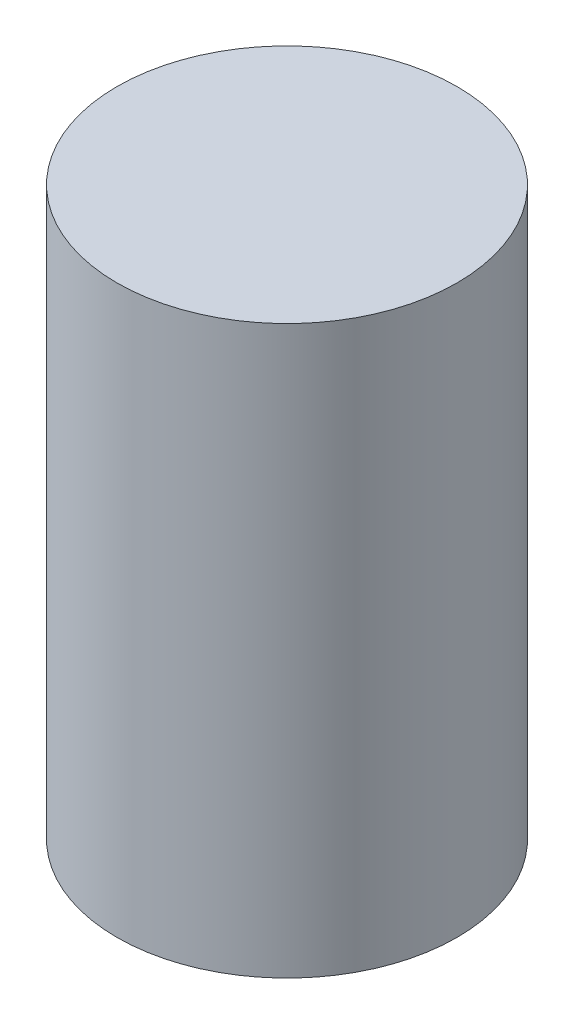
ISO-10303-21;
HEADER;
FILE_DESCRIPTION(('STEP AP214'),'2;1');
FILE_NAME('part.step','',(''),(''),'','','');
FILE_SCHEMA(('AUTOMOTIVE_DESIGN { 1 0 10303 214 1 1 1 1 }'));
ENDSEC;
DATA;
#1=APPLICATION_CONTEXT('core data for automotive mechanical design processes');
#2=APPLICATION_PROTOCOL_DEFINITION('international standard','automotive_design',2000,#1);
#3=PRODUCT_CONTEXT('',#1,'mechanical');
#4=PRODUCT('Part','Part','',(#3));
#5=PRODUCT_RELATED_PRODUCT_CATEGORY('part','',(#4));
#6=PRODUCT_DEFINITION_FORMATION('','',#4);
#7=PRODUCT_DEFINITION_CONTEXT('part definition',#1,'design');
#8=PRODUCT_DEFINITION('design','',#6,#7);
#9=PRODUCT_DEFINITION_SHAPE('','',#8);
#10=(LENGTH_UNIT() NAMED_UNIT(*) SI_UNIT(.MILLI.,.METRE.));
#11=(NAMED_UNIT(*) PLANE_ANGLE_UNIT() SI_UNIT($,.RADIAN.));
#12=(NAMED_UNIT(*) SI_UNIT($,.STERADIAN.) SOLID_ANGLE_UNIT());
#13=UNCERTAINTY_MEASURE_WITH_UNIT(LENGTH_MEASURE(1.E-05),#10,'distance_accuracy_value','');
#14=(GEOMETRIC_REPRESENTATION_CONTEXT(3) GLOBAL_UNCERTAINTY_ASSIGNED_CONTEXT((#13)) GLOBAL_UNIT_ASSIGNED_CONTEXT((#10,
#11,#12)) REPRESENTATION_CONTEXT('',''));
#15=CARTESIAN_POINT('',(0.,0.,0.));
#16=DIRECTION('',(0.,0.,1.));
#17=DIRECTION('',(1.,0.,0.));
#18=AXIS2_PLACEMENT_3D('',#15,#16,#17);
#19=CARTESIAN_POINT('',(0.,5.,0.));
#20=DIRECTION('',(0.,-1.,0.));
#21=DIRECTION('',(0.,0.,-1.));
#22=AXIS2_PLACEMENT_3D('',#19,#20,#21);
#23=CYLINDRICAL_SURFACE('',#22,1.5);
#24=CARTESIAN_POINT('',(0.,5.,0.));
#25=DIRECTION('',(0.,1.,0.));
#26=DIRECTION('',(0.,0.,1.));
#27=AXIS2_PLACEMENT_3D('',#24,#25,#26);
#28=CIRCLE('',#27,1.5);
#29=CARTESIAN_POINT('',(0.,5.,1.5));
#30=VERTEX_POINT('',#29);
#31=EDGE_CURVE('E10',#30,#30,#28,.T.);
#32=ORIENTED_EDGE('',*,*,#31,.F.);
#33=EDGE_LOOP('',(#32));
#34=FACE_BOUND('',#33,.T.);
#35=CARTESIAN_POINT('',(0.,0.,0.));
#36=DIRECTION('',(0.,1.,0.));
#37=DIRECTION('',(0.,0.,1.));
#38=AXIS2_PLACEMENT_3D('',#35,#36,#37);
#39=CIRCLE('',#38,1.5);
#40=CARTESIAN_POINT('',(0.,0.,1.5));
#41=VERTEX_POINT('',#40);
#42=EDGE_CURVE('E46',#41,#41,#39,.T.);
#43=ORIENTED_EDGE('',*,*,#42,.T.);
#44=EDGE_LOOP('',(#43));
#45=FACE_BOUND('',#44,.T.);
#46=ADVANCED_FACE('F43',(#34,#45),#23,.T.);
#47=CARTESIAN_POINT('',(0.,5.,0.));
#48=DIRECTION('',(0.,1.,0.));
#49=DIRECTION('',(0.,0.,1.));
#50=AXIS2_PLACEMENT_3D('',#47,#48,#49);
#51=PLANE('',#50);
#52=ORIENTED_EDGE('',*,*,#31,.T.);
#53=EDGE_LOOP('',(#52));
#54=FACE_BOUND('',#53,.T.);
#55=ADVANCED_FACE('F60',(#54),#51,.T.);
#56=CARTESIAN_POINT('',(0.,0.,0.));
#57=DIRECTION('',(0.,1.,0.));
#58=DIRECTION('',(0.,0.,1.));
#59=AXIS2_PLACEMENT_3D('',#56,#57,#58);
#60=PLANE('',#59);
#61=ORIENTED_EDGE('',*,*,#42,.F.);
#62=EDGE_LOOP('',(#61));
#63=FACE_BOUND('',#62,.T.);
#64=ADVANCED_FACE('F58',(#63),#60,.F.);
#65=CLOSED_SHELL('',(#46,#55,#64));
#66=MANIFOLD_SOLID_BREP('B2',#65);
#67=ADVANCED_BREP_SHAPE_REPRESENTATION('',(#18,#66),#14);
#68=SHAPE_DEFINITION_REPRESENTATION(#9,#67);
ENDSEC;
END-ISO-10303-21;
